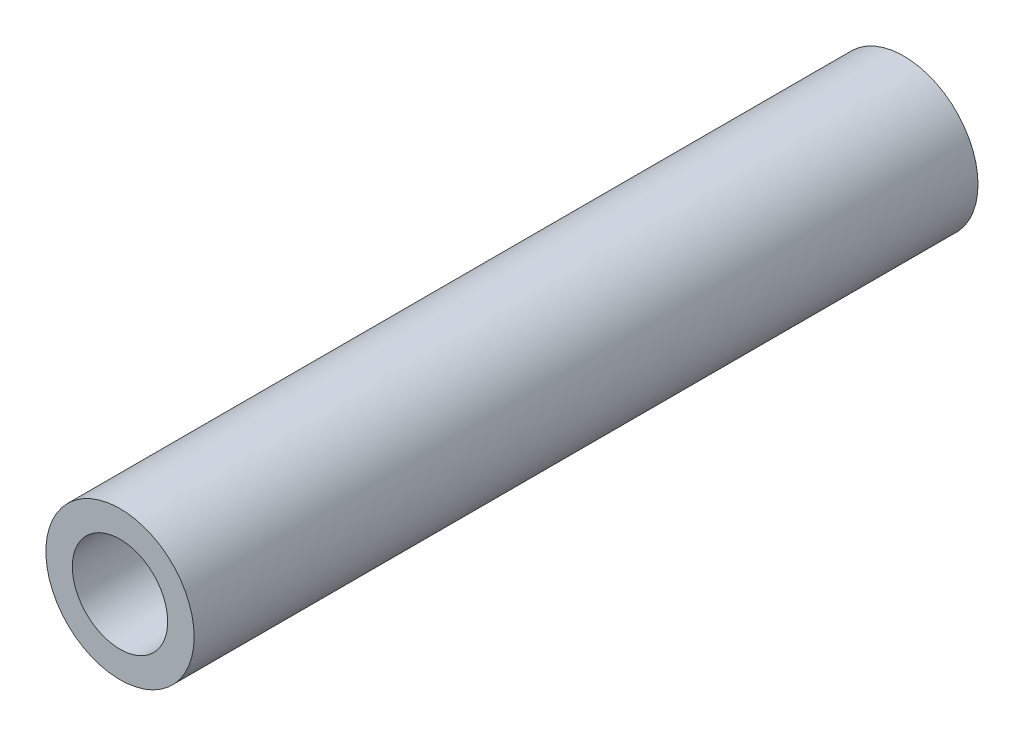
ISO-10303-21;
HEADER;
FILE_DESCRIPTION(('STEP AP214'),'2;1');
FILE_NAME('part.step','',(''),(''),'','','');
FILE_SCHEMA(('AUTOMOTIVE_DESIGN { 1 0 10303 214 1 1 1 1 }'));
ENDSEC;
DATA;
#1=APPLICATION_CONTEXT('core data for automotive mechanical design processes');
#2=APPLICATION_PROTOCOL_DEFINITION('international standard','automotive_design',2000,#1);
#3=PRODUCT_CONTEXT('',#1,'mechanical');
#4=PRODUCT('Part','Part','',(#3));
#5=PRODUCT_RELATED_PRODUCT_CATEGORY('part','',(#4));
#6=PRODUCT_DEFINITION_FORMATION('','',#4);
#7=PRODUCT_DEFINITION_CONTEXT('part definition',#1,'design');
#8=PRODUCT_DEFINITION('design','',#6,#7);
#9=PRODUCT_DEFINITION_SHAPE('','',#8);
#10=(LENGTH_UNIT() NAMED_UNIT(*) SI_UNIT(.MILLI.,.METRE.));
#11=(NAMED_UNIT(*) PLANE_ANGLE_UNIT() SI_UNIT($,.RADIAN.));
#12=(NAMED_UNIT(*) SI_UNIT($,.STERADIAN.) SOLID_ANGLE_UNIT());
#13=UNCERTAINTY_MEASURE_WITH_UNIT(LENGTH_MEASURE(1.E-05),#10,'distance_accuracy_value','');
#14=(GEOMETRIC_REPRESENTATION_CONTEXT(3) GLOBAL_UNCERTAINTY_ASSIGNED_CONTEXT((#13)) GLOBAL_UNIT_ASSIGNED_CONTEXT((#10,
#11,#12)) REPRESENTATION_CONTEXT('',''));
#15=CARTESIAN_POINT('',(0.,0.,0.));
#16=DIRECTION('',(0.,0.,1.));
#17=DIRECTION('',(1.,0.,0.));
#18=AXIS2_PLACEMENT_3D('',#15,#16,#17);
#19=CARTESIAN_POINT('',(0.,0.,37.));
#20=DIRECTION('',(0.,0.,-1.));
#21=DIRECTION('',(-1.,0.,0.));
#22=AXIS2_PLACEMENT_3D('',#19,#20,#21);
#23=CYLINDRICAL_SURFACE('',#22,3.5);
#24=CARTESIAN_POINT('',(0.,0.,37.));
#25=DIRECTION('',(0.,0.,1.));
#26=DIRECTION('',(1.,0.,0.));
#27=AXIS2_PLACEMENT_3D('',#24,#25,#26);
#28=CIRCLE('',#27,3.5);
#29=CARTESIAN_POINT('',(3.5,0.,37.));
#30=VERTEX_POINT('',#29);
#31=EDGE_CURVE('E10',#30,#30,#28,.T.);
#32=ORIENTED_EDGE('',*,*,#31,.F.);
#33=EDGE_LOOP('',(#32));
#34=FACE_BOUND('',#33,.T.);
#35=CARTESIAN_POINT('',(0.,0.,0.));
#36=DIRECTION('',(0.,0.,1.));
#37=DIRECTION('',(1.,0.,0.));
#38=AXIS2_PLACEMENT_3D('',#35,#36,#37);
#39=CIRCLE('',#38,3.5);
#40=CARTESIAN_POINT('',(3.5,0.,0.));
#41=VERTEX_POINT('',#40);
#42=EDGE_CURVE('E50',#41,#41,#39,.T.);
#43=ORIENTED_EDGE('',*,*,#42,.T.);
#44=EDGE_LOOP('',(#43));
#45=FACE_BOUND('',#44,.T.);
#46=ADVANCED_FACE('F47',(#34,#45),#23,.T.);
#47=CARTESIAN_POINT('',(0.,0.,37.));
#48=DIRECTION('',(0.,0.,1.));
#49=DIRECTION('',(1.,0.,0.));
#50=AXIS2_PLACEMENT_3D('',#47,#48,#49);
#51=PLANE('',#50);
#52=CARTESIAN_POINT('',(0.,0.,37.));
#53=DIRECTION('',(0.,0.,-1.));
#54=DIRECTION('',(-1.,0.,0.));
#55=AXIS2_PLACEMENT_3D('',#52,#53,#54);
#56=CIRCLE('',#55,2.24999999999999);
#57=CARTESIAN_POINT('',(-2.24999999999999,0.,37.));
#58=VERTEX_POINT('',#57);
#59=EDGE_CURVE('E61',#58,#58,#56,.T.);
#60=ORIENTED_EDGE('',*,*,#59,.T.);
#61=EDGE_LOOP('',(#60));
#62=FACE_BOUND('',#61,.T.);
#63=ORIENTED_EDGE('',*,*,#31,.T.);
#64=EDGE_LOOP('',(#63));
#65=FACE_BOUND('',#64,.T.);
#66=ADVANCED_FACE('F76',(#62,#65),#51,.T.);
#67=CARTESIAN_POINT('',(0.,0.,0.));
#68=DIRECTION('',(0.,0.,1.));
#69=DIRECTION('',(1.,0.,0.));
#70=AXIS2_PLACEMENT_3D('',#67,#68,#69);
#71=PLANE('',#70);
#72=CARTESIAN_POINT('',(0.,0.,0.));
#73=DIRECTION('',(0.,0.,-1.));
#74=DIRECTION('',(-1.,0.,0.));
#75=AXIS2_PLACEMENT_3D('',#72,#73,#74);
#76=CIRCLE('',#75,2.25);
#77=CARTESIAN_POINT('',(-2.25,0.,0.));
#78=VERTEX_POINT('',#77);
#79=EDGE_CURVE('E65',#78,#78,#76,.T.);
#80=ORIENTED_EDGE('',*,*,#79,.F.);
#81=EDGE_LOOP('',(#80));
#82=FACE_BOUND('',#81,.T.);
#83=ORIENTED_EDGE('',*,*,#42,.F.);
#84=EDGE_LOOP('',(#83));
#85=FACE_BOUND('',#84,.T.);
#86=ADVANCED_FACE('F73',(#82,#85),#71,.F.);
#87=CARTESIAN_POINT('',(0.,0.,0.));
#88=DIRECTION('',(0.,0.,-1.));
#89=DIRECTION('',(-1.,0.,0.));
#90=AXIS2_PLACEMENT_3D('',#87,#88,#89);
#91=CYLINDRICAL_SURFACE('',#90,2.25);
#92=ORIENTED_EDGE('',*,*,#59,.F.);
#93=EDGE_LOOP('',(#92));
#94=FACE_BOUND('',#93,.T.);
#95=ORIENTED_EDGE('',*,*,#79,.T.);
#96=EDGE_LOOP('',(#95));
#97=FACE_BOUND('',#96,.T.);
#98=ADVANCED_FACE('F71',(#94,#97),#91,.F.);
#99=CLOSED_SHELL('',(#46,#66,#86,#98));
#100=MANIFOLD_SOLID_BREP('B2',#99);
#101=ADVANCED_BREP_SHAPE_REPRESENTATION('',(#18,#100),#14);
#102=SHAPE_DEFINITION_REPRESENTATION(#9,#101);
ENDSEC;
END-ISO-10303-21;
